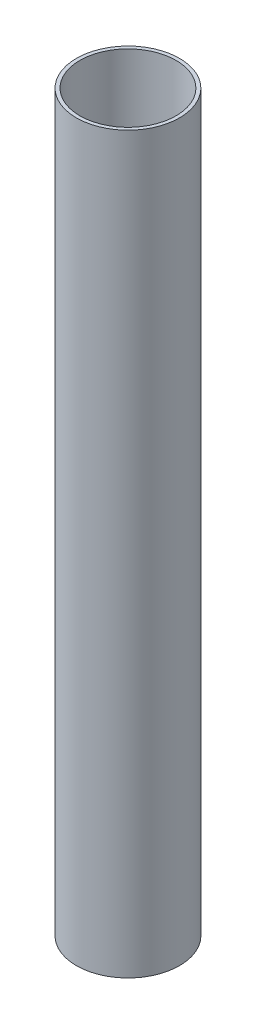
ISO-10303-21;
HEADER;
FILE_DESCRIPTION(('STEP AP214'),'2;1');
FILE_NAME('part.step','',(''),(''),'','','');
FILE_SCHEMA(('AUTOMOTIVE_DESIGN { 1 0 10303 214 1 1 1 1 }'));
ENDSEC;
DATA;
#1=APPLICATION_CONTEXT('core data for automotive mechanical design processes');
#2=APPLICATION_PROTOCOL_DEFINITION('international standard','automotive_design',2000,#1);
#3=PRODUCT_CONTEXT('',#1,'mechanical');
#4=PRODUCT('Part','Part','',(#3));
#5=PRODUCT_RELATED_PRODUCT_CATEGORY('part','',(#4));
#6=PRODUCT_DEFINITION_FORMATION('','',#4);
#7=PRODUCT_DEFINITION_CONTEXT('part definition',#1,'design');
#8=PRODUCT_DEFINITION('design','',#6,#7);
#9=PRODUCT_DEFINITION_SHAPE('','',#8);
#10=(LENGTH_UNIT() NAMED_UNIT(*) SI_UNIT(.MILLI.,.METRE.));
#11=(NAMED_UNIT(*) PLANE_ANGLE_UNIT() SI_UNIT($,.RADIAN.));
#12=(NAMED_UNIT(*) SI_UNIT($,.STERADIAN.) SOLID_ANGLE_UNIT());
#13=UNCERTAINTY_MEASURE_WITH_UNIT(LENGTH_MEASURE(1.E-05),#10,'distance_accuracy_value','');
#14=(GEOMETRIC_REPRESENTATION_CONTEXT(3) GLOBAL_UNCERTAINTY_ASSIGNED_CONTEXT((#13)) GLOBAL_UNIT_ASSIGNED_CONTEXT((#10,
#11,#12)) REPRESENTATION_CONTEXT('',''));
#15=CARTESIAN_POINT('',(0.,0.,0.));
#16=DIRECTION('',(0.,0.,1.));
#17=DIRECTION('',(1.,0.,0.));
#18=AXIS2_PLACEMENT_3D('',#15,#16,#17);
#19=CARTESIAN_POINT('',(0.,420.,0.));
#20=DIRECTION('',(0.,1.,0.));
#21=DIRECTION('',(0.,0.,1.));
#22=AXIS2_PLACEMENT_3D('',#19,#20,#21);
#23=PLANE('',#22);
#24=CARTESIAN_POINT('',(0.,420.,0.));
#25=DIRECTION('',(0.,1.,0.));
#26=DIRECTION('',(0.,0.,1.));
#27=AXIS2_PLACEMENT_3D('',#24,#25,#26);
#28=CIRCLE('',#27,29.5);
#29=CARTESIAN_POINT('',(0.,420.,29.5));
#30=VERTEX_POINT('',#29);
#31=EDGE_CURVE('E10',#30,#30,#28,.T.);
#32=ORIENTED_EDGE('',*,*,#31,.T.);
#33=EDGE_LOOP('',(#32));
#34=FACE_BOUND('',#33,.T.);
#35=CARTESIAN_POINT('',(0.,420.,0.));
#36=DIRECTION('',(0.,1.,0.));
#37=DIRECTION('',(0.,0.,1.));
#38=AXIS2_PLACEMENT_3D('',#35,#36,#37);
#39=CIRCLE('',#38,27.5);
#40=CARTESIAN_POINT('',(0.,420.,27.5));
#41=VERTEX_POINT('',#40);
#42=EDGE_CURVE('E42',#41,#41,#39,.T.);
#43=ORIENTED_EDGE('',*,*,#42,.F.);
#44=EDGE_LOOP('',(#43));
#45=FACE_BOUND('',#44,.T.);
#46=ADVANCED_FACE('F31',(#34,#45),#23,.T.);
#47=CARTESIAN_POINT('',(0.,0.,0.));
#48=DIRECTION('',(0.,1.,0.));
#49=DIRECTION('',(0.,0.,1.));
#50=AXIS2_PLACEMENT_3D('',#47,#48,#49);
#51=PLANE('',#50);
#52=CARTESIAN_POINT('',(0.,0.,0.));
#53=DIRECTION('',(0.,1.,0.));
#54=DIRECTION('',(0.,0.,1.));
#55=AXIS2_PLACEMENT_3D('',#52,#53,#54);
#56=CIRCLE('',#55,29.5);
#57=CARTESIAN_POINT('',(0.,0.,29.5));
#58=VERTEX_POINT('',#57);
#59=EDGE_CURVE('E35',#58,#58,#56,.T.);
#60=ORIENTED_EDGE('',*,*,#59,.F.);
#61=EDGE_LOOP('',(#60));
#62=FACE_BOUND('',#61,.T.);
#63=CARTESIAN_POINT('',(0.,0.,0.));
#64=DIRECTION('',(0.,1.,0.));
#65=DIRECTION('',(0.,0.,1.));
#66=AXIS2_PLACEMENT_3D('',#63,#64,#65);
#67=CIRCLE('',#66,27.5);
#68=CARTESIAN_POINT('',(0.,0.,27.5));
#69=VERTEX_POINT('',#68);
#70=EDGE_CURVE('E44',#69,#69,#67,.T.);
#71=ORIENTED_EDGE('',*,*,#70,.T.);
#72=EDGE_LOOP('',(#71));
#73=FACE_BOUND('',#72,.T.);
#74=ADVANCED_FACE('F54',(#62,#73),#51,.F.);
#75=CARTESIAN_POINT('',(0.,420.,0.));
#76=DIRECTION('',(0.,-1.,0.));
#77=DIRECTION('',(0.,0.,-1.));
#78=AXIS2_PLACEMENT_3D('',#75,#76,#77);
#79=CYLINDRICAL_SURFACE('',#78,29.5);
#80=ORIENTED_EDGE('',*,*,#31,.F.);
#81=EDGE_LOOP('',(#80));
#82=FACE_BOUND('',#81,.T.);
#83=ORIENTED_EDGE('',*,*,#59,.T.);
#84=EDGE_LOOP('',(#83));
#85=FACE_BOUND('',#84,.T.);
#86=ADVANCED_FACE('F33',(#82,#85),#79,.T.);
#87=CARTESIAN_POINT('',(0.,420.,0.));
#88=DIRECTION('',(0.,-1.,0.));
#89=DIRECTION('',(0.,0.,-1.));
#90=AXIS2_PLACEMENT_3D('',#87,#88,#89);
#91=CYLINDRICAL_SURFACE('',#90,27.5);
#92=ORIENTED_EDGE('',*,*,#42,.T.);
#93=EDGE_LOOP('',(#92));
#94=FACE_BOUND('',#93,.T.);
#95=ORIENTED_EDGE('',*,*,#70,.F.);
#96=EDGE_LOOP('',(#95));
#97=FACE_BOUND('',#96,.T.);
#98=ADVANCED_FACE('F50',(#94,#97),#91,.F.);
#99=CLOSED_SHELL('',(#46,#74,#86,#98));
#100=MANIFOLD_SOLID_BREP('B2',#99);
#101=ADVANCED_BREP_SHAPE_REPRESENTATION('',(#18,#100),#14);
#102=SHAPE_DEFINITION_REPRESENTATION(#9,#101);
ENDSEC;
END-ISO-10303-21;
